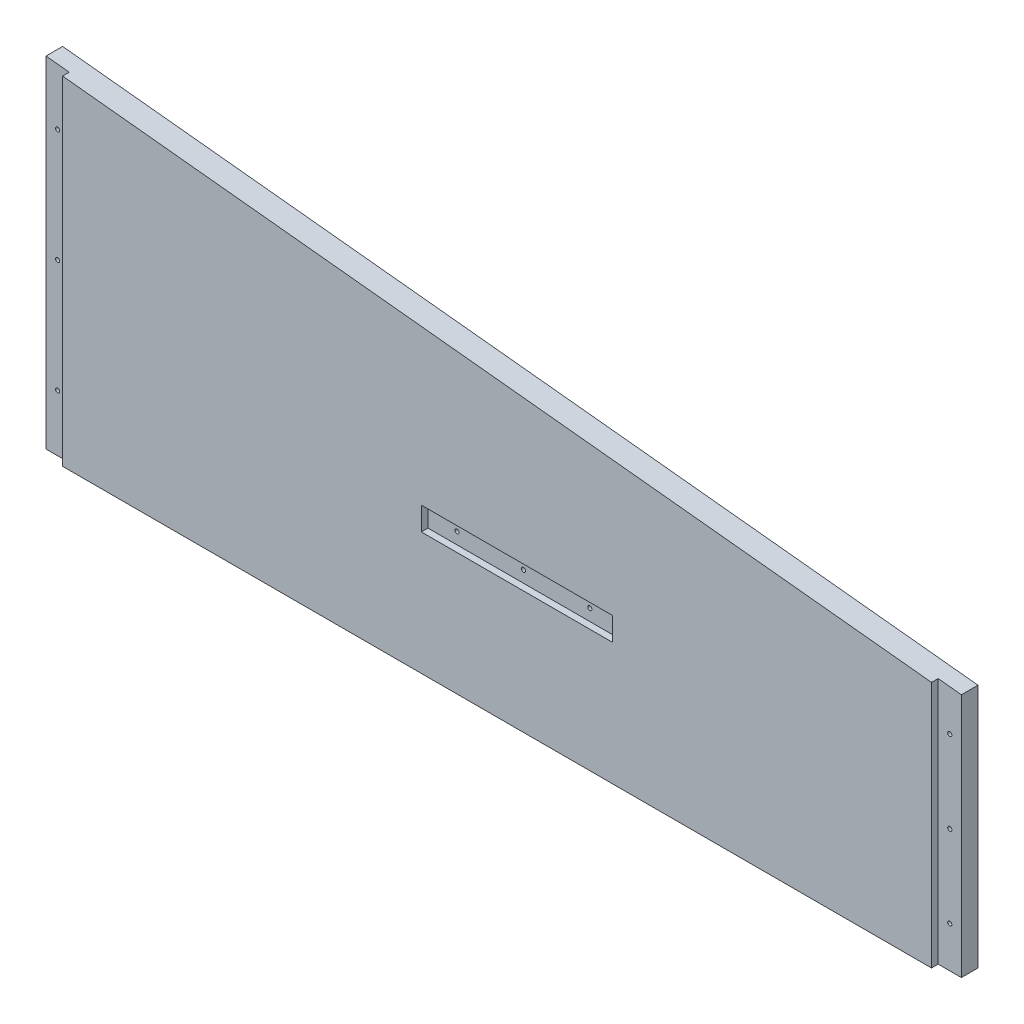
ISO-10303-21;
HEADER;
FILE_DESCRIPTION(('STEP AP214'),'2;1');
FILE_NAME('part.step','',(''),(''),'','','');
FILE_SCHEMA(('AUTOMOTIVE_DESIGN { 1 0 10303 214 1 1 1 1 }'));
ENDSEC;
DATA;
#1=APPLICATION_CONTEXT('core data for automotive mechanical design processes');
#2=APPLICATION_PROTOCOL_DEFINITION('international standard','automotive_design',2000,#1);
#3=PRODUCT_CONTEXT('',#1,'mechanical');
#4=PRODUCT('Part','Part','',(#3));
#5=PRODUCT_RELATED_PRODUCT_CATEGORY('part','',(#4));
#6=PRODUCT_DEFINITION_FORMATION('','',#4);
#7=PRODUCT_DEFINITION_CONTEXT('part definition',#1,'design');
#8=PRODUCT_DEFINITION('design','',#6,#7);
#9=PRODUCT_DEFINITION_SHAPE('','',#8);
#10=(LENGTH_UNIT() NAMED_UNIT(*) SI_UNIT(.MILLI.,.METRE.));
#11=(NAMED_UNIT(*) PLANE_ANGLE_UNIT() SI_UNIT($,.RADIAN.));
#12=(NAMED_UNIT(*) SI_UNIT($,.STERADIAN.) SOLID_ANGLE_UNIT());
#13=UNCERTAINTY_MEASURE_WITH_UNIT(LENGTH_MEASURE(1.E-05),#10,'distance_accuracy_value','');
#14=(GEOMETRIC_REPRESENTATION_CONTEXT(3) GLOBAL_UNCERTAINTY_ASSIGNED_CONTEXT((#13)) GLOBAL_UNIT_ASSIGNED_CONTEXT((#10,
#11,#12)) REPRESENTATION_CONTEXT('',''));
#15=CARTESIAN_POINT('',(0.,0.,0.));
#16=DIRECTION('',(0.,0.,1.));
#17=DIRECTION('',(1.,0.,0.));
#18=AXIS2_PLACEMENT_3D('',#15,#16,#17);
#19=CARTESIAN_POINT('',(471.4875,-5910.834,-22.270128060535));
#20=DIRECTION('',(0.,0.,1.));
#21=DIRECTION('',(1.,0.,0.));
#22=AXIS2_PLACEMENT_3D('',#19,#20,#21);
#23=CYLINDRICAL_SURFACE('',#22,1.58750000000001);
#24=CARTESIAN_POINT('',(471.4875,-5910.834,-17.78));
#25=DIRECTION('',(0.,0.,1.));
#26=DIRECTION('',(1.,0.,0.));
#27=AXIS2_PLACEMENT_3D('',#24,#25,#26);
#28=CIRCLE('',#27,1.58750000000001);
#29=CARTESIAN_POINT('',(473.075,-5910.834,-17.78));
#30=VERTEX_POINT('',#29);
#31=EDGE_CURVE('E220',#30,#30,#28,.F.);
#32=ORIENTED_EDGE('',*,*,#31,.T.);
#33=EDGE_LOOP('',(#32));
#34=FACE_BOUND('',#33,.T.);
#35=CARTESIAN_POINT('',(471.4875,-5910.834,-5.08));
#36=DIRECTION('',(0.,0.,1.));
#37=DIRECTION('',(1.,0.,0.));
#38=AXIS2_PLACEMENT_3D('',#35,#36,#37);
#39=CIRCLE('',#38,1.58750000000001);
#40=CARTESIAN_POINT('',(473.075,-5910.834,-5.08));
#41=VERTEX_POINT('',#40);
#42=EDGE_CURVE('E165',#41,#41,#39,.F.);
#43=ORIENTED_EDGE('',*,*,#42,.F.);
#44=EDGE_LOOP('',(#43));
#45=FACE_BOUND('',#44,.T.);
#46=ADVANCED_FACE('F31',(#34,#45),#23,.F.);
#47=CARTESIAN_POINT('',(522.2875,-5910.834,-22.270128060535));
#48=DIRECTION('',(0.,0.,1.));
#49=DIRECTION('',(1.,0.,0.));
#50=AXIS2_PLACEMENT_3D('',#47,#48,#49);
#51=CYLINDRICAL_SURFACE('',#50,1.58749999999985);
#52=CARTESIAN_POINT('',(522.2875,-5910.834,-17.78));
#53=DIRECTION('',(0.,0.,1.));
#54=DIRECTION('',(1.,0.,0.));
#55=AXIS2_PLACEMENT_3D('',#52,#53,#54);
#56=CIRCLE('',#55,1.58749999999985);
#57=CARTESIAN_POINT('',(523.875,-5910.834,-17.78));
#58=VERTEX_POINT('',#57);
#59=EDGE_CURVE('E217',#58,#58,#56,.F.);
#60=ORIENTED_EDGE('',*,*,#59,.T.);
#61=EDGE_LOOP('',(#60));
#62=FACE_BOUND('',#61,.T.);
#63=CARTESIAN_POINT('',(522.2875,-5910.834,-5.08));
#64=DIRECTION('',(0.,0.,1.));
#65=DIRECTION('',(1.,0.,0.));
#66=AXIS2_PLACEMENT_3D('',#63,#64,#65);
#67=CIRCLE('',#66,1.58749999999985);
#68=CARTESIAN_POINT('',(523.875,-5910.834,-5.08));
#69=VERTEX_POINT('',#68);
#70=EDGE_CURVE('E162',#69,#69,#67,.F.);
#71=ORIENTED_EDGE('',*,*,#70,.F.);
#72=EDGE_LOOP('',(#71));
#73=FACE_BOUND('',#72,.T.);
#74=ADVANCED_FACE('F341',(#62,#73),#51,.F.);
#75=CARTESIAN_POINT('',(573.0875,-5910.834,-22.270128060535));
#76=DIRECTION('',(0.,0.,1.));
#77=DIRECTION('',(1.,0.,0.));
#78=AXIS2_PLACEMENT_3D('',#75,#76,#77);
#79=CYLINDRICAL_SURFACE('',#78,1.58749999999996);
#80=CARTESIAN_POINT('',(573.0875,-5910.834,-17.78));
#81=DIRECTION('',(0.,0.,1.));
#82=DIRECTION('',(1.,0.,0.));
#83=AXIS2_PLACEMENT_3D('',#80,#81,#82);
#84=CIRCLE('',#83,1.58749999999996);
#85=CARTESIAN_POINT('',(574.675,-5910.834,-17.78));
#86=VERTEX_POINT('',#85);
#87=EDGE_CURVE('E214',#86,#86,#84,.F.);
#88=ORIENTED_EDGE('',*,*,#87,.T.);
#89=EDGE_LOOP('',(#88));
#90=FACE_BOUND('',#89,.T.);
#91=CARTESIAN_POINT('',(573.0875,-5910.834,-5.08));
#92=DIRECTION('',(0.,0.,1.));
#93=DIRECTION('',(1.,0.,0.));
#94=AXIS2_PLACEMENT_3D('',#91,#92,#93);
#95=CIRCLE('',#94,1.58749999999996);
#96=CARTESIAN_POINT('',(574.675,-5910.834,-5.08));
#97=VERTEX_POINT('',#96);
#98=EDGE_CURVE('E35',#97,#97,#95,.F.);
#99=ORIENTED_EDGE('',*,*,#98,.F.);
#100=EDGE_LOOP('',(#99));
#101=FACE_BOUND('',#100,.T.);
#102=ADVANCED_FACE('F347',(#90,#101),#79,.F.);
#103=CARTESIAN_POINT('',(157.1625,-5753.1,-17.78));
#104=DIRECTION('',(-1.,0.,0.));
#105=DIRECTION('',(0.,0.,1.));
#106=AXIS2_PLACEMENT_3D('',#103,#104,#105);
#107=PLANE('',#106);
#108=DIRECTION('',(0.,0.,1.));
#109=VECTOR('',#108,1.);
#110=CARTESIAN_POINT('',(157.1625,-6013.45,-17.78));
#111=LINE('',#110,#109);
#112=CARTESIAN_POINT('',(157.1625,-6013.45,-17.78));
#113=VERTEX_POINT('',#112);
#114=CARTESIAN_POINT('',(157.1625,-6013.45,-5.08));
#115=VERTEX_POINT('',#114);
#116=EDGE_CURVE('E255',#113,#115,#111,.T.);
#117=ORIENTED_EDGE('',*,*,#116,.T.);
#118=DIRECTION('',(0.,-1.,0.));
#119=VECTOR('',#118,1.);
#120=CARTESIAN_POINT('',(157.1625,-5753.1,-5.08));
#121=LINE('',#120,#119);
#122=CARTESIAN_POINT('',(157.1625,-5753.1,-5.08));
#123=VERTEX_POINT('',#122);
#124=EDGE_CURVE('E191',#123,#115,#121,.T.);
#125=ORIENTED_EDGE('',*,*,#124,.F.);
#126=DIRECTION('',(0.,0.,1.));
#127=VECTOR('',#126,1.);
#128=CARTESIAN_POINT('',(157.1625,-5753.1,-17.78));
#129=LINE('',#128,#127);
#130=CARTESIAN_POINT('',(157.1625,-5753.1,-17.78));
#131=VERTEX_POINT('',#130);
#132=EDGE_CURVE('E11',#131,#123,#129,.T.);
#133=ORIENTED_EDGE('',*,*,#132,.F.);
#134=DIRECTION('',(0.,-1.,0.));
#135=VECTOR('',#134,1.);
#136=CARTESIAN_POINT('',(157.1625,-5753.1,-17.78));
#137=LINE('',#136,#135);
#138=EDGE_CURVE('E242',#131,#113,#137,.T.);
#139=ORIENTED_EDGE('',*,*,#138,.T.);
#140=EDGE_LOOP('',(#117,#125,#133,#139));
#141=FACE_BOUND('',#140,.T.);
#142=ADVANCED_FACE('F33',(#141),#107,.T.);
#143=CARTESIAN_POINT('',(166.0525,-5970.21288359912,-22.270128060535));
#144=DIRECTION('',(0.,0.,1.));
#145=DIRECTION('',(1.,0.,0.));
#146=AXIS2_PLACEMENT_3D('',#143,#144,#145);
#147=CYLINDRICAL_SURFACE('',#146,1.58749999999977);
#148=CARTESIAN_POINT('',(166.0525,-5970.21288359912,-17.78));
#149=DIRECTION('',(0.,0.,1.));
#150=DIRECTION('',(1.,0.,0.));
#151=AXIS2_PLACEMENT_3D('',#148,#149,#150);
#152=CIRCLE('',#151,1.58749999999977);
#153=CARTESIAN_POINT('',(167.64,-5970.21288359912,-17.78));
#154=VERTEX_POINT('',#153);
#155=EDGE_CURVE('E238',#154,#154,#152,.F.);
#156=ORIENTED_EDGE('',*,*,#155,.T.);
#157=EDGE_LOOP('',(#156));
#158=FACE_BOUND('',#157,.T.);
#159=CARTESIAN_POINT('',(166.0525,-5970.21288359912,-5.08));
#160=DIRECTION('',(0.,0.,1.));
#161=DIRECTION('',(1.,0.,0.));
#162=AXIS2_PLACEMENT_3D('',#159,#160,#161);
#163=CIRCLE('',#162,1.58749999999977);
#164=CARTESIAN_POINT('',(167.64,-5970.21288359912,-5.08));
#165=VERTEX_POINT('',#164);
#166=EDGE_CURVE('E206',#165,#165,#163,.F.);
#167=ORIENTED_EDGE('',*,*,#166,.F.);
#168=EDGE_LOOP('',(#167));
#169=FACE_BOUND('',#168,.T.);
#170=ADVANCED_FACE('F451',(#158,#169),#147,.F.);
#171=CARTESIAN_POINT('',(166.0525,-5883.73865079482,-22.270128060535));
#172=DIRECTION('',(0.,0.,1.));
#173=DIRECTION('',(1.,0.,0.));
#174=AXIS2_PLACEMENT_3D('',#171,#172,#173);
#175=CYLINDRICAL_SURFACE('',#174,1.5874999999999);
#176=CARTESIAN_POINT('',(166.0525,-5883.73865079482,-17.78));
#177=DIRECTION('',(0.,0.,1.));
#178=DIRECTION('',(1.,0.,0.));
#179=AXIS2_PLACEMENT_3D('',#176,#177,#178);
#180=CIRCLE('',#179,1.5874999999999);
#181=CARTESIAN_POINT('',(167.64,-5883.73865079482,-17.78));
#182=VERTEX_POINT('',#181);
#183=EDGE_CURVE('E235',#182,#182,#180,.F.);
#184=ORIENTED_EDGE('',*,*,#183,.T.);
#185=EDGE_LOOP('',(#184));
#186=FACE_BOUND('',#185,.T.);
#187=CARTESIAN_POINT('',(166.0525,-5883.73865079482,-5.08));
#188=DIRECTION('',(0.,0.,1.));
#189=DIRECTION('',(1.,0.,0.));
#190=AXIS2_PLACEMENT_3D('',#187,#188,#189);
#191=CIRCLE('',#190,1.5874999999999);
#192=CARTESIAN_POINT('',(167.64,-5883.73865079482,-5.08));
#193=VERTEX_POINT('',#192);
#194=EDGE_CURVE('E203',#193,#193,#191,.F.);
#195=ORIENTED_EDGE('',*,*,#194,.F.);
#196=EDGE_LOOP('',(#195));
#197=FACE_BOUND('',#196,.T.);
#198=ADVANCED_FACE('F458',(#186,#197),#175,.F.);
#199=CARTESIAN_POINT('',(166.0525,-5797.26441799052,-22.270128060535));
#200=DIRECTION('',(0.,0.,1.));
#201=DIRECTION('',(1.,0.,0.));
#202=AXIS2_PLACEMENT_3D('',#199,#200,#201);
#203=CYLINDRICAL_SURFACE('',#202,1.58749999999977);
#204=CARTESIAN_POINT('',(166.0525,-5797.26441799052,-17.78));
#205=DIRECTION('',(0.,0.,1.));
#206=DIRECTION('',(1.,0.,0.));
#207=AXIS2_PLACEMENT_3D('',#204,#205,#206);
#208=CIRCLE('',#207,1.58749999999977);
#209=CARTESIAN_POINT('',(167.64,-5797.26441799052,-17.78));
#210=VERTEX_POINT('',#209);
#211=EDGE_CURVE('E232',#210,#210,#208,.F.);
#212=ORIENTED_EDGE('',*,*,#211,.T.);
#213=EDGE_LOOP('',(#212));
#214=FACE_BOUND('',#213,.T.);
#215=CARTESIAN_POINT('',(166.0525,-5797.26441799052,-5.08));
#216=DIRECTION('',(0.,0.,1.));
#217=DIRECTION('',(1.,0.,0.));
#218=AXIS2_PLACEMENT_3D('',#215,#216,#217);
#219=CIRCLE('',#218,1.58749999999977);
#220=CARTESIAN_POINT('',(167.64,-5797.26441799052,-5.08));
#221=VERTEX_POINT('',#220);
#222=EDGE_CURVE('E202',#221,#221,#219,.F.);
#223=ORIENTED_EDGE('',*,*,#222,.F.);
#224=EDGE_LOOP('',(#223));
#225=FACE_BOUND('',#224,.T.);
#226=ADVANCED_FACE('F467',(#214,#225),#203,.F.);
#227=CARTESIAN_POINT('',(857.25,-5826.125,-17.78));
#228=DIRECTION('',(0.103745528759361,0.994603873540839,0.));
#229=DIRECTION('',(-0.994603873540839,0.103745528759361,0.));
#230=AXIS2_PLACEMENT_3D('',#227,#228,#229);
#231=PLANE('',#230);
#232=DIRECTION('',(0.,0.,1.));
#233=VECTOR('',#232,1.);
#234=CARTESIAN_POINT('',(839.47,-5824.2703968254,-5.08));
#235=LINE('',#234,#233);
#236=CARTESIAN_POINT('',(839.47,-5824.2703968254,-5.08));
#237=VERTEX_POINT('',#236);
#238=CARTESIAN_POINT('',(839.469999999994,-5824.2703968254,0.));
#239=VERTEX_POINT('',#238);
#240=EDGE_CURVE('E56',#237,#239,#235,.T.);
#241=ORIENTED_EDGE('',*,*,#240,.F.);
#242=DIRECTION('',(-0.994603873540839,0.103745528759361,0.));
#243=VECTOR('',#242,1.);
#244=CARTESIAN_POINT('',(857.25,-5826.125,-5.08));
#245=LINE('',#244,#243);
#246=CARTESIAN_POINT('',(857.25,-5826.125,-5.08));
#247=VERTEX_POINT('',#246);
#248=EDGE_CURVE('E188',#247,#237,#245,.T.);
#249=ORIENTED_EDGE('',*,*,#248,.F.);
#250=DIRECTION('',(0.,0.,1.));
#251=VECTOR('',#250,1.);
#252=CARTESIAN_POINT('',(857.25,-5826.125,-17.78));
#253=LINE('',#252,#251);
#254=CARTESIAN_POINT('',(857.25,-5826.125,-17.78));
#255=VERTEX_POINT('',#254);
#256=EDGE_CURVE('E40',#255,#247,#253,.T.);
#257=ORIENTED_EDGE('',*,*,#256,.F.);
#258=DIRECTION('',(-0.994603873540839,0.103745528759361,0.));
#259=VECTOR('',#258,1.);
#260=CARTESIAN_POINT('',(857.25,-5826.125,-17.78));
#261=LINE('',#260,#259);
#262=EDGE_CURVE('E252',#255,#131,#261,.T.);
#263=ORIENTED_EDGE('',*,*,#262,.T.);
#264=ORIENTED_EDGE('',*,*,#132,.T.);
#265=DIRECTION('',(0.994603873540839,-0.103745528759361,0.));
#266=VECTOR('',#265,1.);
#267=CARTESIAN_POINT('',(857.25,-5826.125,-5.08));
#268=LINE('',#267,#266);
#269=CARTESIAN_POINT('',(174.9425,-5754.9546031746,-5.08));
#270=VERTEX_POINT('',#269);
#271=EDGE_CURVE('E209',#123,#270,#268,.T.);
#272=ORIENTED_EDGE('',*,*,#271,.T.);
#273=DIRECTION('',(0.,0.,-1.));
#274=VECTOR('',#273,1.);
#275=CARTESIAN_POINT('',(174.9425,-5754.9546031746,-17.78));
#276=LINE('',#275,#274);
#277=CARTESIAN_POINT('',(174.9425,-5754.9546031746,0.));
#278=VERTEX_POINT('',#277);
#279=EDGE_CURVE('E212',#278,#270,#276,.T.);
#280=ORIENTED_EDGE('',*,*,#279,.F.);
#281=DIRECTION('',(-0.994603873540839,0.103745528759361,0.));
#282=VECTOR('',#281,1.);
#283=CARTESIAN_POINT('',(857.25,-5826.125,0.));
#284=LINE('',#283,#282);
#285=EDGE_CURVE('E246',#239,#278,#284,.T.);
#286=ORIENTED_EDGE('',*,*,#285,.F.);
#287=EDGE_LOOP('',(#241,#249,#257,#263,#264,#272,#280,#286));
#288=FACE_BOUND('',#287,.T.);
#289=ADVANCED_FACE('F308',(#288),#231,.T.);
#290=CARTESIAN_POINT('',(857.25,-6013.45,-17.78));
#291=DIRECTION('',(1.,0.,0.));
#292=DIRECTION('',(0.,0.,-1.));
#293=AXIS2_PLACEMENT_3D('',#290,#291,#292);
#294=PLANE('',#293);
#295=DIRECTION('',(0.,1.,0.));
#296=VECTOR('',#295,1.);
#297=CARTESIAN_POINT('',(857.25,-5824.2703968254,-5.08));
#298=LINE('',#297,#296);
#299=CARTESIAN_POINT('',(857.25,-6013.45,-5.08));
#300=VERTEX_POINT('',#299);
#301=EDGE_CURVE('E169',#300,#247,#298,.T.);
#302=ORIENTED_EDGE('',*,*,#301,.F.);
#303=DIRECTION('',(0.,0.,1.));
#304=VECTOR('',#303,1.);
#305=CARTESIAN_POINT('',(857.25,-6013.45,-17.78));
#306=LINE('',#305,#304);
#307=CARTESIAN_POINT('',(857.25,-6013.45,-17.78));
#308=VERTEX_POINT('',#307);
#309=EDGE_CURVE('E261',#308,#300,#306,.T.);
#310=ORIENTED_EDGE('',*,*,#309,.F.);
#311=DIRECTION('',(0.,1.,0.));
#312=VECTOR('',#311,1.);
#313=CARTESIAN_POINT('',(857.25,-6013.45,-17.78));
#314=LINE('',#313,#312);
#315=EDGE_CURVE('E249',#308,#255,#314,.T.);
#316=ORIENTED_EDGE('',*,*,#315,.T.);
#317=ORIENTED_EDGE('',*,*,#256,.T.);
#318=EDGE_LOOP('',(#302,#310,#316,#317));
#319=FACE_BOUND('',#318,.T.);
#320=ADVANCED_FACE('F312',(#319),#294,.T.);
#321=CARTESIAN_POINT('',(157.1625,-6013.45,-17.78));
#322=DIRECTION('',(0.,-1.,0.));
#323=DIRECTION('',(0.,0.,-1.));
#324=AXIS2_PLACEMENT_3D('',#321,#322,#323);
#325=PLANE('',#324);
#326=DIRECTION('',(0.,0.,1.));
#327=VECTOR('',#326,1.);
#328=CARTESIAN_POINT('',(839.47,-6013.45,-5.08));
#329=LINE('',#328,#327);
#330=CARTESIAN_POINT('',(839.47,-6013.45,-5.08));
#331=VERTEX_POINT('',#330);
#332=CARTESIAN_POINT('',(839.47,-6013.45,0.));
#333=VERTEX_POINT('',#332);
#334=EDGE_CURVE('E177',#331,#333,#329,.T.);
#335=ORIENTED_EDGE('',*,*,#334,.T.);
#336=DIRECTION('',(1.,0.,0.));
#337=VECTOR('',#336,1.);
#338=CARTESIAN_POINT('',(157.1625,-6013.45,0.));
#339=LINE('',#338,#337);
#340=CARTESIAN_POINT('',(174.9425,-6013.45,0.));
#341=VERTEX_POINT('',#340);
#342=EDGE_CURVE('E241',#341,#333,#339,.T.);
#343=ORIENTED_EDGE('',*,*,#342,.F.);
#344=DIRECTION('',(0.,0.,1.));
#345=VECTOR('',#344,1.);
#346=CARTESIAN_POINT('',(174.9425,-6013.45,-5.08));
#347=LINE('',#346,#345);
#348=CARTESIAN_POINT('',(174.9425,-6013.45,-5.08));
#349=VERTEX_POINT('',#348);
#350=EDGE_CURVE('E198',#349,#341,#347,.T.);
#351=ORIENTED_EDGE('',*,*,#350,.F.);
#352=DIRECTION('',(1.,0.,0.));
#353=VECTOR('',#352,1.);
#354=CARTESIAN_POINT('',(157.1625,-6013.45,-5.08));
#355=LINE('',#354,#353);
#356=EDGE_CURVE('E193',#115,#349,#355,.T.);
#357=ORIENTED_EDGE('',*,*,#356,.F.);
#358=ORIENTED_EDGE('',*,*,#116,.F.);
#359=DIRECTION('',(1.,0.,0.));
#360=VECTOR('',#359,1.);
#361=CARTESIAN_POINT('',(157.1625,-6013.45,-17.78));
#362=LINE('',#361,#360);
#363=EDGE_CURVE('E245',#113,#308,#362,.T.);
#364=ORIENTED_EDGE('',*,*,#363,.T.);
#365=ORIENTED_EDGE('',*,*,#309,.T.);
#366=DIRECTION('',(1.,0.,0.));
#367=VECTOR('',#366,1.);
#368=CARTESIAN_POINT('',(857.25,-6013.45,-5.08));
#369=LINE('',#368,#367);
#370=EDGE_CURVE('E174',#331,#300,#369,.T.);
#371=ORIENTED_EDGE('',*,*,#370,.F.);
#372=EDGE_LOOP('',(#335,#343,#351,#357,#358,#364,#365,#371));
#373=FACE_BOUND('',#372,.T.);
#374=ADVANCED_FACE('F293',(#373),#325,.T.);
#375=CARTESIAN_POINT('',(157.1625,-6013.45,-17.78));
#376=DIRECTION('',(0.,0.,1.));
#377=DIRECTION('',(1.,0.,0.));
#378=AXIS2_PLACEMENT_3D('',#375,#376,#377);
#379=PLANE('',#378);
#380=ORIENTED_EDGE('',*,*,#87,.F.);
#381=EDGE_LOOP('',(#380));
#382=FACE_BOUND('',#381,.T.);
#383=ORIENTED_EDGE('',*,*,#59,.F.);
#384=EDGE_LOOP('',(#383));
#385=FACE_BOUND('',#384,.T.);
#386=ORIENTED_EDGE('',*,*,#31,.F.);
#387=EDGE_LOOP('',(#386));
#388=FACE_BOUND('',#387,.T.);
#389=CARTESIAN_POINT('',(848.36,-5856.57308200948,-17.78));
#390=DIRECTION('',(0.,0.,1.));
#391=DIRECTION('',(1.,0.,0.));
#392=AXIS2_PLACEMENT_3D('',#389,#390,#391);
#393=CIRCLE('',#392,1.58749999999964);
#394=CARTESIAN_POINT('',(849.9475,-5856.57308200948,-17.78));
#395=VERTEX_POINT('',#394);
#396=EDGE_CURVE('E223',#395,#395,#393,.F.);
#397=ORIENTED_EDGE('',*,*,#396,.F.);
#398=EDGE_LOOP('',(#397));
#399=FACE_BOUND('',#398,.T.);
#400=CARTESIAN_POINT('',(848.36,-5919.32384920518,-17.78));
#401=DIRECTION('',(0.,0.,1.));
#402=DIRECTION('',(1.,0.,0.));
#403=AXIS2_PLACEMENT_3D('',#400,#401,#402);
#404=CIRCLE('',#403,1.58749999999974);
#405=CARTESIAN_POINT('',(849.9475,-5919.32384920518,-17.78));
#406=VERTEX_POINT('',#405);
#407=EDGE_CURVE('E226',#406,#406,#404,.F.);
#408=ORIENTED_EDGE('',*,*,#407,.F.);
#409=EDGE_LOOP('',(#408));
#410=FACE_BOUND('',#409,.T.);
#411=CARTESIAN_POINT('',(848.36,-5982.07461640088,-17.78));
#412=DIRECTION('',(0.,0.,1.));
#413=DIRECTION('',(1.,0.,0.));
#414=AXIS2_PLACEMENT_3D('',#411,#412,#413);
#415=CIRCLE('',#414,1.58749999999974);
#416=CARTESIAN_POINT('',(849.9475,-5982.07461640088,-17.78));
#417=VERTEX_POINT('',#416);
#418=EDGE_CURVE('E229',#417,#417,#415,.F.);
#419=ORIENTED_EDGE('',*,*,#418,.F.);
#420=EDGE_LOOP('',(#419));
#421=FACE_BOUND('',#420,.T.);
#422=ORIENTED_EDGE('',*,*,#211,.F.);
#423=EDGE_LOOP('',(#422));
#424=FACE_BOUND('',#423,.T.);
#425=ORIENTED_EDGE('',*,*,#183,.F.);
#426=EDGE_LOOP('',(#425));
#427=FACE_BOUND('',#426,.T.);
#428=ORIENTED_EDGE('',*,*,#155,.F.);
#429=EDGE_LOOP('',(#428));
#430=FACE_BOUND('',#429,.T.);
#431=ORIENTED_EDGE('',*,*,#138,.F.);
#432=ORIENTED_EDGE('',*,*,#262,.F.);
#433=ORIENTED_EDGE('',*,*,#315,.F.);
#434=ORIENTED_EDGE('',*,*,#363,.F.);
#435=EDGE_LOOP('',(#431,#432,#433,#434));
#436=FACE_BOUND('',#435,.T.);
#437=ADVANCED_FACE('F290',(#382,#385,#388,#399,#410,#421,#424,#427,#430,#436),#379,.F.);
#438=CARTESIAN_POINT('',(157.1625,-6013.45,0.));
#439=DIRECTION('',(0.,0.,1.));
#440=DIRECTION('',(1.,0.,0.));
#441=AXIS2_PLACEMENT_3D('',#438,#439,#440);
#442=PLANE('',#441);
#443=DIRECTION('',(0.,-1.,0.));
#444=VECTOR('',#443,1.);
#445=CARTESIAN_POINT('',(449.262499998773,-5901.944,0.));
#446=LINE('',#445,#444);
#447=CARTESIAN_POINT('',(449.262499998773,-5901.944,0.));
#448=VERTEX_POINT('',#447);
#449=CARTESIAN_POINT('',(449.262499998773,-5919.724,0.));
#450=VERTEX_POINT('',#449);
#451=EDGE_CURVE('E48',#448,#450,#446,.T.);
#452=ORIENTED_EDGE('',*,*,#451,.F.);
#453=DIRECTION('',(-1.,0.,0.));
#454=VECTOR('',#453,1.);
#455=CARTESIAN_POINT('',(449.262499998773,-5901.944,0.));
#456=LINE('',#455,#454);
#457=CARTESIAN_POINT('',(595.312500001227,-5901.944,0.));
#458=VERTEX_POINT('',#457);
#459=EDGE_CURVE('E144',#458,#448,#456,.T.);
#460=ORIENTED_EDGE('',*,*,#459,.F.);
#461=DIRECTION('',(0.,1.,0.));
#462=VECTOR('',#461,1.);
#463=CARTESIAN_POINT('',(595.312500001227,-5901.944,0.));
#464=LINE('',#463,#462);
#465=CARTESIAN_POINT('',(595.312500001227,-5919.724,0.));
#466=VERTEX_POINT('',#465);
#467=EDGE_CURVE('E147',#466,#458,#464,.T.);
#468=ORIENTED_EDGE('',*,*,#467,.F.);
#469=DIRECTION('',(1.,0.,0.));
#470=VECTOR('',#469,1.);
#471=CARTESIAN_POINT('',(449.262499998773,-5919.724,0.));
#472=LINE('',#471,#470);
#473=EDGE_CURVE('E153',#450,#466,#472,.T.);
#474=ORIENTED_EDGE('',*,*,#473,.F.);
#475=EDGE_LOOP('',(#452,#460,#468,#474));
#476=FACE_BOUND('',#475,.T.);
#477=DIRECTION('',(0.,-1.,0.));
#478=VECTOR('',#477,1.);
#479=CARTESIAN_POINT('',(839.47,-6013.45,0.));
#480=LINE('',#479,#478);
#481=EDGE_CURVE('E168',#239,#333,#480,.T.);
#482=ORIENTED_EDGE('',*,*,#481,.F.);
#483=ORIENTED_EDGE('',*,*,#285,.T.);
#484=DIRECTION('',(0.,1.,0.));
#485=VECTOR('',#484,1.);
#486=CARTESIAN_POINT('',(174.9425,-6013.45,0.));
#487=LINE('',#486,#485);
#488=EDGE_CURVE('E190',#341,#278,#487,.T.);
#489=ORIENTED_EDGE('',*,*,#488,.F.);
#490=ORIENTED_EDGE('',*,*,#342,.T.);
#491=EDGE_LOOP('',(#482,#483,#489,#490));
#492=FACE_BOUND('',#491,.T.);
#493=ADVANCED_FACE('F286',(#476,#492),#442,.T.);
#494=CARTESIAN_POINT('',(848.36,-5982.07461640088,-22.270128060535));
#495=DIRECTION('',(0.,0.,1.));
#496=DIRECTION('',(1.,0.,0.));
#497=AXIS2_PLACEMENT_3D('',#494,#495,#496);
#498=CYLINDRICAL_SURFACE('',#497,1.58749999999974);
#499=CARTESIAN_POINT('',(848.36,-5982.07461640088,-5.08));
#500=DIRECTION('',(0.,0.,-1.));
#501=DIRECTION('',(-1.,0.,0.));
#502=AXIS2_PLACEMENT_3D('',#499,#500,#501);
#503=CIRCLE('',#502,1.58749999999974);
#504=CARTESIAN_POINT('',(846.7725,-5982.07461640088,-5.08));
#505=VERTEX_POINT('',#504);
#506=EDGE_CURVE('E185',#505,#505,#503,.F.);
#507=ORIENTED_EDGE('',*,*,#506,.T.);
#508=EDGE_LOOP('',(#507));
#509=FACE_BOUND('',#508,.T.);
#510=ORIENTED_EDGE('',*,*,#418,.T.);
#511=EDGE_LOOP('',(#510));
#512=FACE_BOUND('',#511,.T.);
#513=ADVANCED_FACE('F282',(#509,#512),#498,.F.);
#514=CARTESIAN_POINT('',(848.36,-5919.32384920518,-22.270128060535));
#515=DIRECTION('',(0.,0.,1.));
#516=DIRECTION('',(1.,0.,0.));
#517=AXIS2_PLACEMENT_3D('',#514,#515,#516);
#518=CYLINDRICAL_SURFACE('',#517,1.58749999999974);
#519=CARTESIAN_POINT('',(848.36,-5919.32384920518,-5.08));
#520=DIRECTION('',(0.,0.,-1.));
#521=DIRECTION('',(-1.,0.,0.));
#522=AXIS2_PLACEMENT_3D('',#519,#520,#521);
#523=CIRCLE('',#522,1.58749999999974);
#524=CARTESIAN_POINT('',(846.7725,-5919.32384920518,-5.08));
#525=VERTEX_POINT('',#524);
#526=EDGE_CURVE('E182',#525,#525,#523,.F.);
#527=ORIENTED_EDGE('',*,*,#526,.T.);
#528=EDGE_LOOP('',(#527));
#529=FACE_BOUND('',#528,.T.);
#530=ORIENTED_EDGE('',*,*,#407,.T.);
#531=EDGE_LOOP('',(#530));
#532=FACE_BOUND('',#531,.T.);
#533=ADVANCED_FACE('F285',(#529,#532),#518,.F.);
#534=CARTESIAN_POINT('',(848.36,-5856.57308200948,-22.270128060535));
#535=DIRECTION('',(0.,0.,1.));
#536=DIRECTION('',(1.,0.,0.));
#537=AXIS2_PLACEMENT_3D('',#534,#535,#536);
#538=CYLINDRICAL_SURFACE('',#537,1.58749999999964);
#539=CARTESIAN_POINT('',(848.36,-5856.57308200948,-5.08));
#540=DIRECTION('',(0.,0.,-1.));
#541=DIRECTION('',(-1.,0.,0.));
#542=AXIS2_PLACEMENT_3D('',#539,#540,#541);
#543=CIRCLE('',#542,1.58749999999964);
#544=CARTESIAN_POINT('',(846.7725,-5856.57308200948,-5.08));
#545=VERTEX_POINT('',#544);
#546=EDGE_CURVE('E180',#545,#545,#543,.F.);
#547=ORIENTED_EDGE('',*,*,#546,.T.);
#548=EDGE_LOOP('',(#547));
#549=FACE_BOUND('',#548,.T.);
#550=ORIENTED_EDGE('',*,*,#396,.T.);
#551=EDGE_LOOP('',(#550));
#552=FACE_BOUND('',#551,.T.);
#553=ADVANCED_FACE('F270',(#549,#552),#538,.F.);
#554=CARTESIAN_POINT('',(157.1625,-5753.1,-5.08));
#555=DIRECTION('',(0.,0.,1.));
#556=DIRECTION('',(1.,0.,0.));
#557=AXIS2_PLACEMENT_3D('',#554,#555,#556);
#558=PLANE('',#557);
#559=ORIENTED_EDGE('',*,*,#194,.T.);
#560=EDGE_LOOP('',(#559));
#561=FACE_BOUND('',#560,.T.);
#562=ORIENTED_EDGE('',*,*,#124,.T.);
#563=ORIENTED_EDGE('',*,*,#356,.T.);
#564=DIRECTION('',(0.,1.,0.));
#565=VECTOR('',#564,1.);
#566=CARTESIAN_POINT('',(174.9425,-6013.45,-5.08));
#567=LINE('',#566,#565);
#568=EDGE_CURVE('E195',#349,#270,#567,.T.);
#569=ORIENTED_EDGE('',*,*,#568,.T.);
#570=ORIENTED_EDGE('',*,*,#271,.F.);
#571=EDGE_LOOP('',(#562,#563,#569,#570));
#572=FACE_BOUND('',#571,.T.);
#573=ORIENTED_EDGE('',*,*,#222,.T.);
#574=EDGE_LOOP('',(#573));
#575=FACE_BOUND('',#574,.T.);
#576=ORIENTED_EDGE('',*,*,#166,.T.);
#577=EDGE_LOOP('',(#576));
#578=FACE_BOUND('',#577,.T.);
#579=ADVANCED_FACE('F319',(#561,#572,#575,#578),#558,.T.);
#580=CARTESIAN_POINT('',(174.9425,-6013.45,-5.08));
#581=DIRECTION('',(1.,0.,0.));
#582=DIRECTION('',(0.,0.,-1.));
#583=AXIS2_PLACEMENT_3D('',#580,#581,#582);
#584=PLANE('',#583);
#585=ORIENTED_EDGE('',*,*,#279,.T.);
#586=ORIENTED_EDGE('',*,*,#568,.F.);
#587=ORIENTED_EDGE('',*,*,#350,.T.);
#588=ORIENTED_EDGE('',*,*,#488,.T.);
#589=EDGE_LOOP('',(#585,#586,#587,#588));
#590=FACE_BOUND('',#589,.T.);
#591=ADVANCED_FACE('F277',(#590),#584,.F.);
#592=CARTESIAN_POINT('',(857.25,-6013.45,-5.08));
#593=DIRECTION('',(0.,0.,-1.));
#594=DIRECTION('',(-1.,0.,0.));
#595=AXIS2_PLACEMENT_3D('',#592,#593,#594);
#596=PLANE('',#595);
#597=ORIENTED_EDGE('',*,*,#248,.T.);
#598=DIRECTION('',(0.,-1.,0.));
#599=VECTOR('',#598,1.);
#600=CARTESIAN_POINT('',(839.47,-6013.45,-5.08));
#601=LINE('',#600,#599);
#602=EDGE_CURVE('E171',#237,#331,#601,.T.);
#603=ORIENTED_EDGE('',*,*,#602,.T.);
#604=ORIENTED_EDGE('',*,*,#370,.T.);
#605=ORIENTED_EDGE('',*,*,#301,.T.);
#606=EDGE_LOOP('',(#597,#603,#604,#605));
#607=FACE_BOUND('',#606,.T.);
#608=ORIENTED_EDGE('',*,*,#526,.F.);
#609=EDGE_LOOP('',(#608));
#610=FACE_BOUND('',#609,.T.);
#611=ORIENTED_EDGE('',*,*,#546,.F.);
#612=EDGE_LOOP('',(#611));
#613=FACE_BOUND('',#612,.T.);
#614=ORIENTED_EDGE('',*,*,#506,.F.);
#615=EDGE_LOOP('',(#614));
#616=FACE_BOUND('',#615,.T.);
#617=ADVANCED_FACE('F273',(#607,#610,#613,#616),#596,.F.);
#618=CARTESIAN_POINT('',(839.47,-6013.45,-5.08));
#619=DIRECTION('',(-1.,0.,0.));
#620=DIRECTION('',(0.,0.,1.));
#621=AXIS2_PLACEMENT_3D('',#618,#619,#620);
#622=PLANE('',#621);
#623=ORIENTED_EDGE('',*,*,#481,.T.);
#624=ORIENTED_EDGE('',*,*,#334,.F.);
#625=ORIENTED_EDGE('',*,*,#602,.F.);
#626=ORIENTED_EDGE('',*,*,#240,.T.);
#627=EDGE_LOOP('',(#623,#624,#625,#626));
#628=FACE_BOUND('',#627,.T.);
#629=ADVANCED_FACE('F276',(#628),#622,.F.);
#630=CARTESIAN_POINT('',(449.262499998773,-5919.724,-5.08));
#631=DIRECTION('',(0.,0.,1.));
#632=DIRECTION('',(1.,0.,0.));
#633=AXIS2_PLACEMENT_3D('',#630,#631,#632);
#634=PLANE('',#633);
#635=ORIENTED_EDGE('',*,*,#70,.T.);
#636=EDGE_LOOP('',(#635));
#637=FACE_BOUND('',#636,.T.);
#638=DIRECTION('',(0.,-1.,0.));
#639=VECTOR('',#638,1.);
#640=CARTESIAN_POINT('',(449.262499998773,-5901.944,-5.08));
#641=LINE('',#640,#639);
#642=CARTESIAN_POINT('',(449.262499998773,-5901.944,-5.08));
#643=VERTEX_POINT('',#642);
#644=CARTESIAN_POINT('',(449.262499998773,-5919.724,-5.08));
#645=VERTEX_POINT('',#644);
#646=EDGE_CURVE('E125',#643,#645,#641,.T.);
#647=ORIENTED_EDGE('',*,*,#646,.T.);
#648=DIRECTION('',(1.,0.,0.));
#649=VECTOR('',#648,1.);
#650=CARTESIAN_POINT('',(449.262499998773,-5919.724,-5.08));
#651=LINE('',#650,#649);
#652=CARTESIAN_POINT('',(595.312500001227,-5919.724,-5.08));
#653=VERTEX_POINT('',#652);
#654=EDGE_CURVE('E134',#645,#653,#651,.T.);
#655=ORIENTED_EDGE('',*,*,#654,.T.);
#656=DIRECTION('',(0.,1.,0.));
#657=VECTOR('',#656,1.);
#658=CARTESIAN_POINT('',(595.312500001227,-5901.944,-5.08));
#659=LINE('',#658,#657);
#660=CARTESIAN_POINT('',(595.312500001227,-5901.944,-5.08));
#661=VERTEX_POINT('',#660);
#662=EDGE_CURVE('E139',#653,#661,#659,.T.);
#663=ORIENTED_EDGE('',*,*,#662,.T.);
#664=DIRECTION('',(-1.,0.,0.));
#665=VECTOR('',#664,1.);
#666=CARTESIAN_POINT('',(449.262499998773,-5901.944,-5.08));
#667=LINE('',#666,#665);
#668=EDGE_CURVE('E131',#661,#643,#667,.T.);
#669=ORIENTED_EDGE('',*,*,#668,.T.);
#670=EDGE_LOOP('',(#647,#655,#663,#669));
#671=FACE_BOUND('',#670,.T.);
#672=ORIENTED_EDGE('',*,*,#98,.T.);
#673=EDGE_LOOP('',(#672));
#674=FACE_BOUND('',#673,.T.);
#675=ORIENTED_EDGE('',*,*,#42,.T.);
#676=EDGE_LOOP('',(#675));
#677=FACE_BOUND('',#676,.T.);
#678=ADVANCED_FACE('F141',(#637,#671,#674,#677),#634,.T.);
#679=CARTESIAN_POINT('',(449.262499998773,-5901.944,-5.08));
#680=DIRECTION('',(-1.,0.,0.));
#681=DIRECTION('',(0.,0.,1.));
#682=AXIS2_PLACEMENT_3D('',#679,#680,#681);
#683=PLANE('',#682);
#684=ORIENTED_EDGE('',*,*,#451,.T.);
#685=DIRECTION('',(0.,0.,1.));
#686=VECTOR('',#685,1.);
#687=CARTESIAN_POINT('',(449.262499998773,-5919.724,-5.08));
#688=LINE('',#687,#686);
#689=EDGE_CURVE('E121',#645,#450,#688,.T.);
#690=ORIENTED_EDGE('',*,*,#689,.F.);
#691=ORIENTED_EDGE('',*,*,#646,.F.);
#692=DIRECTION('',(0.,0.,1.));
#693=VECTOR('',#692,1.);
#694=CARTESIAN_POINT('',(449.262499998773,-5901.944,-5.08));
#695=LINE('',#694,#693);
#696=EDGE_CURVE('E157',#643,#448,#695,.T.);
#697=ORIENTED_EDGE('',*,*,#696,.T.);
#698=EDGE_LOOP('',(#684,#690,#691,#697));
#699=FACE_BOUND('',#698,.T.);
#700=ADVANCED_FACE('F123',(#699),#683,.F.);
#701=CARTESIAN_POINT('',(449.262499998773,-5901.944,-5.08));
#702=DIRECTION('',(0.,1.,0.));
#703=DIRECTION('',(0.,0.,1.));
#704=AXIS2_PLACEMENT_3D('',#701,#702,#703);
#705=PLANE('',#704);
#706=ORIENTED_EDGE('',*,*,#459,.T.);
#707=ORIENTED_EDGE('',*,*,#696,.F.);
#708=ORIENTED_EDGE('',*,*,#668,.F.);
#709=DIRECTION('',(0.,0.,1.));
#710=VECTOR('',#709,1.);
#711=CARTESIAN_POINT('',(595.312500001227,-5901.944,-5.08));
#712=LINE('',#711,#710);
#713=EDGE_CURVE('E159',#661,#458,#712,.T.);
#714=ORIENTED_EDGE('',*,*,#713,.T.);
#715=EDGE_LOOP('',(#706,#707,#708,#714));
#716=FACE_BOUND('',#715,.T.);
#717=ADVANCED_FACE('F364',(#716),#705,.F.);
#718=CARTESIAN_POINT('',(595.312500001227,-5901.944,-5.08));
#719=DIRECTION('',(1.,0.,0.));
#720=DIRECTION('',(0.,0.,-1.));
#721=AXIS2_PLACEMENT_3D('',#718,#719,#720);
#722=PLANE('',#721);
#723=ORIENTED_EDGE('',*,*,#467,.T.);
#724=ORIENTED_EDGE('',*,*,#713,.F.);
#725=ORIENTED_EDGE('',*,*,#662,.F.);
#726=DIRECTION('',(0.,0.,1.));
#727=VECTOR('',#726,1.);
#728=CARTESIAN_POINT('',(595.312500001227,-5919.724,-5.08));
#729=LINE('',#728,#727);
#730=EDGE_CURVE('E130',#653,#466,#729,.T.);
#731=ORIENTED_EDGE('',*,*,#730,.T.);
#732=EDGE_LOOP('',(#723,#724,#725,#731));
#733=FACE_BOUND('',#732,.T.);
#734=ADVANCED_FACE('F367',(#733),#722,.F.);
#735=CARTESIAN_POINT('',(449.262499998773,-5919.724,-5.08));
#736=DIRECTION('',(0.,-1.,0.));
#737=DIRECTION('',(0.,0.,-1.));
#738=AXIS2_PLACEMENT_3D('',#735,#736,#737);
#739=PLANE('',#738);
#740=ORIENTED_EDGE('',*,*,#473,.T.);
#741=ORIENTED_EDGE('',*,*,#730,.F.);
#742=ORIENTED_EDGE('',*,*,#654,.F.);
#743=ORIENTED_EDGE('',*,*,#689,.T.);
#744=EDGE_LOOP('',(#740,#741,#742,#743));
#745=FACE_BOUND('',#744,.T.);
#746=ADVANCED_FACE('F135',(#745),#739,.F.);
#747=CLOSED_SHELL('',(#46,#74,#102,#142,#170,#198,#226,#289,#320,#374,#437,#493,#513,#533,#553,
#579,#591,#617,#629,#678,#700,#717,#734,#746));
#748=MANIFOLD_SOLID_BREP('B2',#747);
#749=ADVANCED_BREP_SHAPE_REPRESENTATION('',(#18,#748),#14);
#750=SHAPE_DEFINITION_REPRESENTATION(#9,#749);
ENDSEC;
END-ISO-10303-21;
